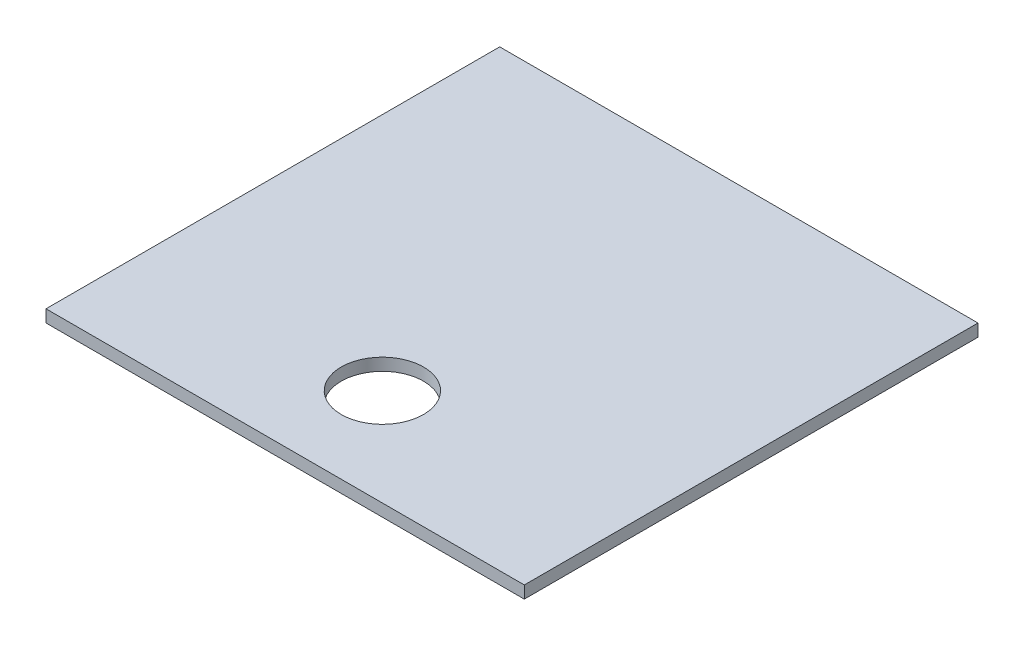
ISO-10303-21;
HEADER;
FILE_DESCRIPTION(('STEP AP214'),'2;1');
FILE_NAME('part.step','',(''),(''),'','','');
FILE_SCHEMA(('AUTOMOTIVE_DESIGN { 1 0 10303 214 1 1 1 1 }'));
ENDSEC;
DATA;
#1=APPLICATION_CONTEXT('core data for automotive mechanical design processes');
#2=APPLICATION_PROTOCOL_DEFINITION('international standard','automotive_design',2000,#1);
#3=PRODUCT_CONTEXT('',#1,'mechanical');
#4=PRODUCT('Part','Part','',(#3));
#5=PRODUCT_RELATED_PRODUCT_CATEGORY('part','',(#4));
#6=PRODUCT_DEFINITION_FORMATION('','',#4);
#7=PRODUCT_DEFINITION_CONTEXT('part definition',#1,'design');
#8=PRODUCT_DEFINITION('design','',#6,#7);
#9=PRODUCT_DEFINITION_SHAPE('','',#8);
#10=(LENGTH_UNIT() NAMED_UNIT(*) SI_UNIT(.MILLI.,.METRE.));
#11=(NAMED_UNIT(*) PLANE_ANGLE_UNIT() SI_UNIT($,.RADIAN.));
#12=(NAMED_UNIT(*) SI_UNIT($,.STERADIAN.) SOLID_ANGLE_UNIT());
#13=UNCERTAINTY_MEASURE_WITH_UNIT(LENGTH_MEASURE(1.E-05),#10,'distance_accuracy_value','');
#14=(GEOMETRIC_REPRESENTATION_CONTEXT(3) GLOBAL_UNCERTAINTY_ASSIGNED_CONTEXT((#13)) GLOBAL_UNIT_ASSIGNED_CONTEXT((#10,
#11,#12)) REPRESENTATION_CONTEXT('',''));
#15=CARTESIAN_POINT('',(0.,0.,0.));
#16=DIRECTION('',(0.,0.,1.));
#17=DIRECTION('',(1.,0.,0.));
#18=AXIS2_PLACEMENT_3D('',#15,#16,#17);
#19=CARTESIAN_POINT('',(36.9,1.9,-35.));
#20=DIRECTION('',(-1.,0.,0.));
#21=DIRECTION('',(0.,0.,1.));
#22=AXIS2_PLACEMENT_3D('',#19,#20,#21);
#23=PLANE('',#22);
#24=DIRECTION('',(0.,0.,-1.));
#25=VECTOR('',#24,1.);
#26=CARTESIAN_POINT('',(36.9,0.,-35.));
#27=LINE('',#26,#25);
#28=CARTESIAN_POINT('',(36.9,0.,35.));
#29=VERTEX_POINT('',#28);
#30=CARTESIAN_POINT('',(36.9,0.,-35.));
#31=VERTEX_POINT('',#30);
#32=EDGE_CURVE('E111',#29,#31,#27,.T.);
#33=ORIENTED_EDGE('',*,*,#32,.T.);
#34=DIRECTION('',(0.,-1.,0.));
#35=VECTOR('',#34,1.);
#36=CARTESIAN_POINT('',(36.9,1.9,-35.));
#37=LINE('',#36,#35);
#38=CARTESIAN_POINT('',(36.9,1.9,-35.));
#39=VERTEX_POINT('',#38);
#40=EDGE_CURVE('E11',#39,#31,#37,.T.);
#41=ORIENTED_EDGE('',*,*,#40,.F.);
#42=DIRECTION('',(0.,0.,-1.));
#43=VECTOR('',#42,1.);
#44=CARTESIAN_POINT('',(36.9,1.9,-35.));
#45=LINE('',#44,#43);
#46=CARTESIAN_POINT('',(36.9,1.9,35.));
#47=VERTEX_POINT('',#46);
#48=EDGE_CURVE('E95',#47,#39,#45,.T.);
#49=ORIENTED_EDGE('',*,*,#48,.F.);
#50=DIRECTION('',(0.,-1.,0.));
#51=VECTOR('',#50,1.);
#52=CARTESIAN_POINT('',(36.9,1.9,35.));
#53=LINE('',#52,#51);
#54=EDGE_CURVE('E107',#47,#29,#53,.T.);
#55=ORIENTED_EDGE('',*,*,#54,.T.);
#56=EDGE_LOOP('',(#33,#41,#49,#55));
#57=FACE_BOUND('',#56,.T.);
#58=ADVANCED_FACE('F43',(#57),#23,.F.);
#59=CARTESIAN_POINT('',(-36.9,1.9,-35.));
#60=DIRECTION('',(0.,0.,1.));
#61=DIRECTION('',(1.,0.,0.));
#62=AXIS2_PLACEMENT_3D('',#59,#60,#61);
#63=PLANE('',#62);
#64=DIRECTION('',(-1.,0.,0.));
#65=VECTOR('',#64,1.);
#66=CARTESIAN_POINT('',(-36.9,0.,-35.));
#67=LINE('',#66,#65);
#68=CARTESIAN_POINT('',(-36.9,0.,-35.));
#69=VERTEX_POINT('',#68);
#70=EDGE_CURVE('E100',#31,#69,#67,.T.);
#71=ORIENTED_EDGE('',*,*,#70,.T.);
#72=DIRECTION('',(0.,-1.,0.));
#73=VECTOR('',#72,1.);
#74=CARTESIAN_POINT('',(-36.9,1.9,-35.));
#75=LINE('',#74,#73);
#76=CARTESIAN_POINT('',(-36.9,1.9,-35.));
#77=VERTEX_POINT('',#76);
#78=EDGE_CURVE('E52',#77,#69,#75,.T.);
#79=ORIENTED_EDGE('',*,*,#78,.F.);
#80=DIRECTION('',(-1.,0.,0.));
#81=VECTOR('',#80,1.);
#82=CARTESIAN_POINT('',(-36.9,1.9,-35.));
#83=LINE('',#82,#81);
#84=EDGE_CURVE('E90',#39,#77,#83,.T.);
#85=ORIENTED_EDGE('',*,*,#84,.F.);
#86=ORIENTED_EDGE('',*,*,#40,.T.);
#87=EDGE_LOOP('',(#71,#79,#85,#86));
#88=FACE_BOUND('',#87,.T.);
#89=ADVANCED_FACE('F99',(#88),#63,.F.);
#90=CARTESIAN_POINT('',(-36.9,1.9,-35.));
#91=DIRECTION('',(1.,0.,0.));
#92=DIRECTION('',(0.,0.,-1.));
#93=AXIS2_PLACEMENT_3D('',#90,#91,#92);
#94=PLANE('',#93);
#95=DIRECTION('',(0.,0.,1.));
#96=VECTOR('',#95,1.);
#97=CARTESIAN_POINT('',(-36.9,0.,-35.));
#98=LINE('',#97,#96);
#99=CARTESIAN_POINT('',(-36.9,0.,35.));
#100=VERTEX_POINT('',#99);
#101=EDGE_CURVE('E77',#69,#100,#98,.T.);
#102=ORIENTED_EDGE('',*,*,#101,.T.);
#103=DIRECTION('',(0.,-1.,0.));
#104=VECTOR('',#103,1.);
#105=CARTESIAN_POINT('',(-36.9,1.9,35.));
#106=LINE('',#105,#104);
#107=CARTESIAN_POINT('',(-36.9,1.9,35.));
#108=VERTEX_POINT('',#107);
#109=EDGE_CURVE('E102',#108,#100,#106,.T.);
#110=ORIENTED_EDGE('',*,*,#109,.F.);
#111=DIRECTION('',(0.,0.,1.));
#112=VECTOR('',#111,1.);
#113=CARTESIAN_POINT('',(-36.9,1.9,-35.));
#114=LINE('',#113,#112);
#115=EDGE_CURVE('E93',#77,#108,#114,.T.);
#116=ORIENTED_EDGE('',*,*,#115,.F.);
#117=ORIENTED_EDGE('',*,*,#78,.T.);
#118=EDGE_LOOP('',(#102,#110,#116,#117));
#119=FACE_BOUND('',#118,.T.);
#120=ADVANCED_FACE('F103',(#119),#94,.F.);
#121=CARTESIAN_POINT('',(-36.9,1.9,35.));
#122=DIRECTION('',(0.,0.,-1.));
#123=DIRECTION('',(-1.,0.,0.));
#124=AXIS2_PLACEMENT_3D('',#121,#122,#123);
#125=PLANE('',#124);
#126=DIRECTION('',(1.,0.,0.));
#127=VECTOR('',#126,1.);
#128=CARTESIAN_POINT('',(-36.9,0.,35.));
#129=LINE('',#128,#127);
#130=EDGE_CURVE('E83',#100,#29,#129,.T.);
#131=ORIENTED_EDGE('',*,*,#130,.T.);
#132=ORIENTED_EDGE('',*,*,#54,.F.);
#133=DIRECTION('',(1.,0.,0.));
#134=VECTOR('',#133,1.);
#135=CARTESIAN_POINT('',(-36.9,1.9,35.));
#136=LINE('',#135,#134);
#137=EDGE_CURVE('E60',#108,#47,#136,.T.);
#138=ORIENTED_EDGE('',*,*,#137,.F.);
#139=ORIENTED_EDGE('',*,*,#109,.T.);
#140=EDGE_LOOP('',(#131,#132,#138,#139));
#141=FACE_BOUND('',#140,.T.);
#142=ADVANCED_FACE('F125',(#141),#125,.F.);
#143=CARTESIAN_POINT('',(0.,1.9,0.));
#144=DIRECTION('',(0.,1.,0.));
#145=DIRECTION('',(0.,0.,1.));
#146=AXIS2_PLACEMENT_3D('',#143,#144,#145);
#147=PLANE('',#146);
#148=CARTESIAN_POINT('',(0.,1.9,20.));
#149=DIRECTION('',(0.,1.,0.));
#150=DIRECTION('',(0.,0.,1.));
#151=AXIS2_PLACEMENT_3D('',#148,#149,#150);
#152=CIRCLE('',#151,6.35);
#153=CARTESIAN_POINT('',(0.,1.9,26.35));
#154=VERTEX_POINT('',#153);
#155=EDGE_CURVE('E132',#154,#154,#152,.T.);
#156=ORIENTED_EDGE('',*,*,#155,.F.);
#157=EDGE_LOOP('',(#156));
#158=FACE_BOUND('',#157,.T.);
#159=ORIENTED_EDGE('',*,*,#48,.T.);
#160=ORIENTED_EDGE('',*,*,#84,.T.);
#161=ORIENTED_EDGE('',*,*,#115,.T.);
#162=ORIENTED_EDGE('',*,*,#137,.T.);
#163=EDGE_LOOP('',(#159,#160,#161,#162));
#164=FACE_BOUND('',#163,.T.);
#165=ADVANCED_FACE('F91',(#158,#164),#147,.T.);
#166=CARTESIAN_POINT('',(0.,0.,0.));
#167=DIRECTION('',(0.,1.,0.));
#168=DIRECTION('',(0.,0.,1.));
#169=AXIS2_PLACEMENT_3D('',#166,#167,#168);
#170=PLANE('',#169);
#171=CARTESIAN_POINT('',(0.,0.,20.));
#172=DIRECTION('',(0.,1.,0.));
#173=DIRECTION('',(0.,0.,1.));
#174=AXIS2_PLACEMENT_3D('',#171,#172,#173);
#175=CIRCLE('',#174,6.35);
#176=CARTESIAN_POINT('',(0.,0.,26.35));
#177=VERTEX_POINT('',#176);
#178=EDGE_CURVE('E115',#177,#177,#175,.T.);
#179=ORIENTED_EDGE('',*,*,#178,.T.);
#180=EDGE_LOOP('',(#179));
#181=FACE_BOUND('',#180,.T.);
#182=ORIENTED_EDGE('',*,*,#32,.F.);
#183=ORIENTED_EDGE('',*,*,#130,.F.);
#184=ORIENTED_EDGE('',*,*,#101,.F.);
#185=ORIENTED_EDGE('',*,*,#70,.F.);
#186=EDGE_LOOP('',(#182,#183,#184,#185));
#187=FACE_BOUND('',#186,.T.);
#188=ADVANCED_FACE('F128',(#181,#187),#170,.F.);
#189=CARTESIAN_POINT('',(0.,0.,20.));
#190=DIRECTION('',(0.,1.,0.));
#191=DIRECTION('',(0.,0.,1.));
#192=AXIS2_PLACEMENT_3D('',#189,#190,#191);
#193=CYLINDRICAL_SURFACE('',#192,6.35);
#194=ORIENTED_EDGE('',*,*,#178,.F.);
#195=EDGE_LOOP('',(#194));
#196=FACE_BOUND('',#195,.T.);
#197=ORIENTED_EDGE('',*,*,#155,.T.);
#198=EDGE_LOOP('',(#197));
#199=FACE_BOUND('',#198,.T.);
#200=ADVANCED_FACE('F141',(#196,#199),#193,.F.);
#201=CLOSED_SHELL('',(#58,#89,#120,#142,#165,#188,#200));
#202=MANIFOLD_SOLID_BREP('B2',#201);
#203=ADVANCED_BREP_SHAPE_REPRESENTATION('',(#18,#202),#14);
#204=SHAPE_DEFINITION_REPRESENTATION(#9,#203);
ENDSEC;
END-ISO-10303-21;
